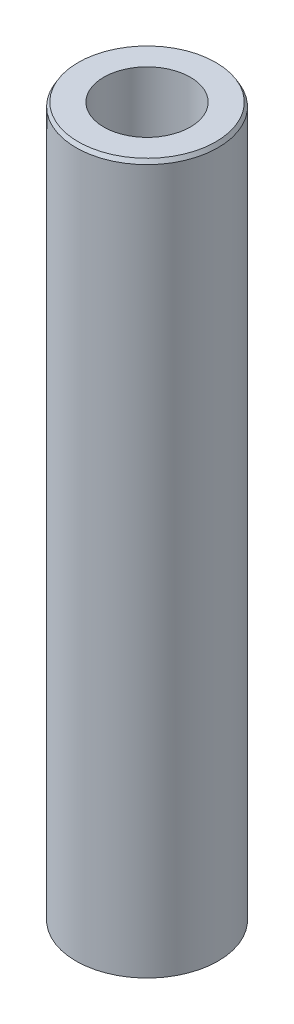
ISO-10303-21;
HEADER;
FILE_DESCRIPTION(('STEP AP214'),'2;1');
FILE_NAME('part.step','',(''),(''),'','','');
FILE_SCHEMA(('AUTOMOTIVE_DESIGN { 1 0 10303 214 1 1 1 1 }'));
ENDSEC;
DATA;
#1=APPLICATION_CONTEXT('core data for automotive mechanical design processes');
#2=APPLICATION_PROTOCOL_DEFINITION('international standard','automotive_design',2000,#1);
#3=PRODUCT_CONTEXT('',#1,'mechanical');
#4=PRODUCT('Part','Part','',(#3));
#5=PRODUCT_RELATED_PRODUCT_CATEGORY('part','',(#4));
#6=PRODUCT_DEFINITION_FORMATION('','',#4);
#7=PRODUCT_DEFINITION_CONTEXT('part definition',#1,'design');
#8=PRODUCT_DEFINITION('design','',#6,#7);
#9=PRODUCT_DEFINITION_SHAPE('','',#8);
#10=(LENGTH_UNIT() NAMED_UNIT(*) SI_UNIT(.MILLI.,.METRE.));
#11=(NAMED_UNIT(*) PLANE_ANGLE_UNIT() SI_UNIT($,.RADIAN.));
#12=(NAMED_UNIT(*) SI_UNIT($,.STERADIAN.) SOLID_ANGLE_UNIT());
#13=UNCERTAINTY_MEASURE_WITH_UNIT(LENGTH_MEASURE(1.E-05),#10,'distance_accuracy_value','');
#14=(GEOMETRIC_REPRESENTATION_CONTEXT(3) GLOBAL_UNCERTAINTY_ASSIGNED_CONTEXT((#13)) GLOBAL_UNIT_ASSIGNED_CONTEXT((#10,
#11,#12)) REPRESENTATION_CONTEXT('',''));
#15=CARTESIAN_POINT('',(0.,0.,0.));
#16=DIRECTION('',(0.,0.,1.));
#17=DIRECTION('',(1.,0.,0.));
#18=AXIS2_PLACEMENT_3D('',#15,#16,#17);
#19=CARTESIAN_POINT('',(0.,600.,0.));
#20=DIRECTION('',(0.,-1.,0.));
#21=DIRECTION('',(0.,0.,-1.));
#22=AXIS2_PLACEMENT_3D('',#19,#20,#21);
#23=CYLINDRICAL_SURFACE('',#22,60.);
#24=CARTESIAN_POINT('',(0.,596.682397411379,0.));
#25=DIRECTION('',(0.,1.,0.));
#26=DIRECTION('',(0.,0.,1.));
#27=AXIS2_PLACEMENT_3D('',#24,#25,#26);
#28=CIRCLE('',#27,60.);
#29=CARTESIAN_POINT('',(0.,596.682397411379,-60.));
#30=VERTEX_POINT('',#29);
#31=EDGE_CURVE('E50',#30,#30,#28,.F.);
#32=CARTESIAN_POINT('',(0.,1.91541874760426,0.));
#33=DIRECTION('',(0.,1.,0.));
#34=DIRECTION('',(0.,0.,1.));
#35=AXIS2_PLACEMENT_3D('',#32,#33,#34);
#36=CIRCLE('',#35,60.);
#37=CARTESIAN_POINT('',(0.,1.91541874760415,-60.));
#38=VERTEX_POINT('',#37);
#39=EDGE_CURVE('E51',#38,#38,#36,.T.);
#40=CARTESIAN_POINT('',(0.,596.682397411379,-60.));
#41=CARTESIAN_POINT('',(0.,590.486908050298,-60.));
#42=CARTESIAN_POINT('',(0.,584.291418689217,-60.));
#43=CARTESIAN_POINT('',(0.,571.900439967055,-60.));
#44=CARTESIAN_POINT('',(0.,565.704950605974,-60.));
#45=CARTESIAN_POINT('',(0.,553.313971883812,-60.));
#46=CARTESIAN_POINT('',(0.,547.118482522731,-60.));
#47=CARTESIAN_POINT('',(0.,534.727503800569,-60.));
#48=CARTESIAN_POINT('',(0.,528.532014439488,-60.));
#49=CARTESIAN_POINT('',(0.,516.141035717327,-60.));
#50=CARTESIAN_POINT('',(0.,509.945546356245,-60.));
#51=CARTESIAN_POINT('',(0.,497.554567634084,-60.));
#52=CARTESIAN_POINT('',(0.,491.359078273002,-60.));
#53=CARTESIAN_POINT('',(0.,478.96809955084,-60.));
#54=CARTESIAN_POINT('',(0.,472.77261018976,-60.));
#55=CARTESIAN_POINT('',(0.,460.381631467598,-60.));
#56=CARTESIAN_POINT('',(0.,454.186142106517,-60.));
#57=CARTESIAN_POINT('',(0.,441.795163384355,-60.));
#58=CARTESIAN_POINT('',(0.,435.599674023274,-60.));
#59=CARTESIAN_POINT('',(0.,423.208695301112,-60.));
#60=CARTESIAN_POINT('',(0.,417.013205940031,-60.));
#61=CARTESIAN_POINT('',(0.,404.622227217869,-60.));
#62=CARTESIAN_POINT('',(0.,398.426737856788,-60.));
#63=CARTESIAN_POINT('',(0.,386.035759134626,-60.));
#64=CARTESIAN_POINT('',(0.,379.840269773545,-60.));
#65=CARTESIAN_POINT('',(0.,367.449291051383,-60.));
#66=CARTESIAN_POINT('',(0.,361.253801690302,-60.));
#67=CARTESIAN_POINT('',(0.,348.86282296814,-60.));
#68=CARTESIAN_POINT('',(0.,342.667333607059,-60.));
#69=CARTESIAN_POINT('',(0.,330.276354884897,-60.));
#70=CARTESIAN_POINT('',(0.,324.080865523816,-60.));
#71=CARTESIAN_POINT('',(0.,311.689886801654,-60.));
#72=CARTESIAN_POINT('',(0.,305.494397440573,-60.));
#73=CARTESIAN_POINT('',(0.,293.103418718411,-60.));
#74=CARTESIAN_POINT('',(0.,286.90792935733,-60.));
#75=CARTESIAN_POINT('',(0.,274.516950635168,-60.));
#76=CARTESIAN_POINT('',(0.,268.321461274087,-60.));
#77=CARTESIAN_POINT('',(0.,255.930482551925,-60.));
#78=CARTESIAN_POINT('',(0.,249.734993190844,-60.));
#79=CARTESIAN_POINT('',(0.,237.344014468682,-60.));
#80=CARTESIAN_POINT('',(0.,231.148525107601,-60.));
#81=CARTESIAN_POINT('',(0.,218.757546385439,-60.));
#82=CARTESIAN_POINT('',(0.,212.562057024358,-60.));
#83=CARTESIAN_POINT('',(0.,200.171078302196,-60.));
#84=CARTESIAN_POINT('',(0.,193.975588941115,-60.));
#85=CARTESIAN_POINT('',(0.,181.584610218953,-60.));
#86=CARTESIAN_POINT('',(0.,175.389120857872,-60.));
#87=CARTESIAN_POINT('',(0.,162.99814213571,-60.));
#88=CARTESIAN_POINT('',(0.,156.802652774629,-60.));
#89=CARTESIAN_POINT('',(0.,144.411674052467,-60.));
#90=CARTESIAN_POINT('',(0.,138.216184691386,-60.));
#91=CARTESIAN_POINT('',(0.,125.825205969224,-60.));
#92=CARTESIAN_POINT('',(0.,119.629716608143,-60.));
#93=CARTESIAN_POINT('',(0.,107.238737885981,-60.));
#94=CARTESIAN_POINT('',(0.,101.0432485249,-60.));
#95=CARTESIAN_POINT('',(0.,88.652269802738,-60.));
#96=CARTESIAN_POINT('',(0.,82.456780441657,-60.));
#97=CARTESIAN_POINT('',(0.,70.0658017194951,-60.));
#98=CARTESIAN_POINT('',(0.,63.8703123584141,-60.));
#99=CARTESIAN_POINT('',(0.,51.4793336362521,-60.));
#100=CARTESIAN_POINT('',(0.,45.283844275171,-60.));
#101=CARTESIAN_POINT('',(0.,32.892865553009,-60.));
#102=CARTESIAN_POINT('',(0.,26.697376191928,-60.));
#103=CARTESIAN_POINT('',(0.,14.306397469766,-60.));
#104=CARTESIAN_POINT('',(0.,8.1109081086851,-60.));
#105=CARTESIAN_POINT('',(0.,1.91541874760415,-60.));
#106=B_SPLINE_CURVE_WITH_KNOTS('',3,(#40,#41,#42,#43,#44,#45,#46,#47,#48,#49,#50,#51,#52,#53,
#54,#55,#56,#57,#58,#59,#60,#61,#62,#63,#64,#65,#66,#67,#68,#69,#70,#71,#72,#73,#74,#75,#76,#77,
#78,#79,#80,#81,#82,#83,#84,#85,#86,#87,#88,#89,#90,#91,#92,#93,#94,#95,#96,#97,#98,#99,#100,
#101,#102,#103,#104,#105),.UNSPECIFIED.,.F.,.F.,(4,2,2,2,2,2,2,2,2,2,2,2,2,2,2,2,2,2,2,2,2,2,2,
2,2,2,2,2,2,2,2,2,4),(0.,18.5864680832429,37.1729361664859,55.7594042497289,74.3458723329719,
92.9323404162148,111.518808499458,130.105276582701,148.691744665944,167.278212749187,
185.86468083243,204.451148915673,223.037616998916,241.624085082159,260.210553165402,
278.797021248645,297.383489331888,315.969957415131,334.556425498374,353.142893581616,
371.729361664859,390.315829748102,408.902297831345,427.488765914588,446.075233997831,
464.661702081074,483.248170164317,501.83463824756,520.421106330803,539.007574414046,
557.594042497289,576.180510580532,594.766978663775),.UNSPECIFIED.);
#107=EDGE_CURVE('BSEAM39',#30,#38,#106,.T.);
#108=ORIENTED_EDGE('',*,*,#31,.T.);
#109=ORIENTED_EDGE('',*,*,#39,.T.);
#110=ORIENTED_EDGE('',*,*,#107,.T.);
#111=ORIENTED_EDGE('',*,*,#107,.F.);
#112=EDGE_LOOP('',(#108,#110,#109,#111));
#113=FACE_BOUND('',#112,.T.);
#114=ADVANCED_FACE('F39',(#113),#23,.T.);
#115=CARTESIAN_POINT('',(0.,600.,0.));
#116=DIRECTION('',(0.,1.,0.));
#117=DIRECTION('',(0.,0.,1.));
#118=AXIS2_PLACEMENT_3D('',#115,#116,#117);
#119=PLANE('',#118);
#120=CARTESIAN_POINT('',(0.,600.,0.));
#121=DIRECTION('',(0.,1.,0.));
#122=DIRECTION('',(0.,0.,1.));
#123=AXIS2_PLACEMENT_3D('',#120,#121,#122);
#124=CIRCLE('',#123,58.0845812523958);
#125=CARTESIAN_POINT('',(0.,600.,-58.0845812523958));
#126=VERTEX_POINT('',#125);
#127=EDGE_CURVE('E54',#126,#126,#124,.T.);
#128=ORIENTED_EDGE('',*,*,#127,.T.);
#129=EDGE_LOOP('',(#128));
#130=FACE_BOUND('',#129,.T.);
#131=CARTESIAN_POINT('',(0.,600.,0.));
#132=DIRECTION('',(0.,1.,0.));
#133=DIRECTION('',(0.,0.,1.));
#134=AXIS2_PLACEMENT_3D('',#131,#132,#133);
#135=CIRCLE('',#134,36.5133609068791);
#136=CARTESIAN_POINT('',(0.,600.,36.5133609068791));
#137=VERTEX_POINT('',#136);
#138=EDGE_CURVE('E58',#137,#137,#135,.T.);
#139=ORIENTED_EDGE('',*,*,#138,.F.);
#140=EDGE_LOOP('',(#139));
#141=FACE_BOUND('',#140,.T.);
#142=ADVANCED_FACE('F69',(#130,#141),#119,.T.);
#143=CARTESIAN_POINT('',(0.,0.,0.));
#144=DIRECTION('',(0.,1.,0.));
#145=DIRECTION('',(0.,0.,1.));
#146=AXIS2_PLACEMENT_3D('',#143,#144,#145);
#147=PLANE('',#146);
#148=CARTESIAN_POINT('',(0.,0.,0.));
#149=DIRECTION('',(0.,1.,0.));
#150=DIRECTION('',(0.,0.,1.));
#151=AXIS2_PLACEMENT_3D('',#148,#149,#150);
#152=CIRCLE('',#151,56.6823974113794);
#153=CARTESIAN_POINT('',(0.,0.,56.6823974113794));
#154=VERTEX_POINT('',#153);
#155=EDGE_CURVE('E10',#154,#154,#152,.F.);
#156=ORIENTED_EDGE('',*,*,#155,.T.);
#157=EDGE_LOOP('',(#156));
#158=FACE_BOUND('',#157,.T.);
#159=CARTESIAN_POINT('',(0.,0.,0.));
#160=DIRECTION('',(0.,1.,0.));
#161=DIRECTION('',(0.,0.,1.));
#162=AXIS2_PLACEMENT_3D('',#159,#160,#161);
#163=CIRCLE('',#162,36.5133609068791);
#164=CARTESIAN_POINT('',(0.,0.,36.5133609068791));
#165=VERTEX_POINT('',#164);
#166=EDGE_CURVE('E63',#165,#165,#163,.T.);
#167=ORIENTED_EDGE('',*,*,#166,.T.);
#168=EDGE_LOOP('',(#167));
#169=FACE_BOUND('',#168,.T.);
#170=ADVANCED_FACE('F75',(#158,#169),#147,.F.);
#171=CARTESIAN_POINT('',(0.,600.,0.));
#172=DIRECTION('',(0.,-1.,0.));
#173=DIRECTION('',(0.,0.,-1.));
#174=AXIS2_PLACEMENT_3D('',#171,#172,#173);
#175=CYLINDRICAL_SURFACE('',#174,36.5133609068791);
#176=ORIENTED_EDGE('',*,*,#138,.T.);
#177=EDGE_LOOP('',(#176));
#178=FACE_BOUND('',#177,.T.);
#179=ORIENTED_EDGE('',*,*,#166,.F.);
#180=EDGE_LOOP('',(#179));
#181=FACE_BOUND('',#180,.T.);
#182=ADVANCED_FACE('F70',(#178,#181),#175,.F.);
#183=CARTESIAN_POINT('',(0.,600.,0.));
#184=DIRECTION('',(0.,-1.,0.));
#185=DIRECTION('',(0.,0.,-1.));
#186=AXIS2_PLACEMENT_3D('',#183,#184,#185);
#187=CONICAL_SURFACE('',#186,58.0845812523958,0.52359877559828);
#188=CARTESIAN_POINT('',(0.,596.682397411379,-60.));
#189=CARTESIAN_POINT('',(0.,596.716955771677,-59.9800477213792));
#190=CARTESIAN_POINT('',(0.,596.751514131976,-59.9600954427583));
#191=CARTESIAN_POINT('',(0.,596.820630852572,-59.9201908855165));
#192=CARTESIAN_POINT('',(0.,596.85518921287,-59.9002386068956));
#193=CARTESIAN_POINT('',(0.,596.924305933466,-59.8603340496539));
#194=CARTESIAN_POINT('',(0.,596.958864293764,-59.840381771033));
#195=CARTESIAN_POINT('',(0.,597.027981014361,-59.8004772137913));
#196=CARTESIAN_POINT('',(0.,597.062539374659,-59.7805249351704));
#197=CARTESIAN_POINT('',(0.,597.131656095255,-59.7406203779286));
#198=CARTESIAN_POINT('',(0.,597.166214455553,-59.7206680993077));
#199=CARTESIAN_POINT('',(0.,597.235331176149,-59.680763542066));
#200=CARTESIAN_POINT('',(0.,597.269889536448,-59.6608112634451));
#201=CARTESIAN_POINT('',(0.,597.339006257044,-59.6209067062034));
#202=CARTESIAN_POINT('',(0.,597.373564617342,-59.6009544275825));
#203=CARTESIAN_POINT('',(0.,597.442681337938,-59.5610498703407));
#204=CARTESIAN_POINT('',(0.,597.477239698236,-59.5410975917199));
#205=CARTESIAN_POINT('',(0.,597.546356418833,-59.5011930344781));
#206=CARTESIAN_POINT('',(0.,597.580914779131,-59.4812407558572));
#207=CARTESIAN_POINT('',(0.,597.650031499727,-59.4413361986155));
#208=CARTESIAN_POINT('',(0.,597.684589860025,-59.4213839199946));
#209=CARTESIAN_POINT('',(0.,597.753706580621,-59.3814793627528));
#210=CARTESIAN_POINT('',(0.,597.788264940919,-59.361527084132));
#211=CARTESIAN_POINT('',(0.,597.857381661516,-59.3216225268902));
#212=CARTESIAN_POINT('',(0.,597.891940021814,-59.3016702482693));
#213=CARTESIAN_POINT('',(0.,597.96105674241,-59.2617656910276));
#214=CARTESIAN_POINT('',(0.,597.995615102708,-59.2418134124067));
#215=CARTESIAN_POINT('',(0.,598.064731823305,-59.201908855165));
#216=CARTESIAN_POINT('',(0.,598.099290183603,-59.1819565765441));
#217=CARTESIAN_POINT('',(0.,598.168406904199,-59.1420520193023));
#218=CARTESIAN_POINT('',(0.,598.202965264497,-59.1220997406814));
#219=CARTESIAN_POINT('',(0.,598.272081985093,-59.0821951834397));
#220=CARTESIAN_POINT('',(0.,598.306640345392,-59.0622429048188));
#221=CARTESIAN_POINT('',(0.,598.375757065988,-59.0223383475771));
#222=CARTESIAN_POINT('',(0.,598.410315426286,-59.0023860689562));
#223=CARTESIAN_POINT('',(0.,598.479432146882,-58.9624815117144));
#224=CARTESIAN_POINT('',(0.,598.51399050718,-58.9425292330935));
#225=CARTESIAN_POINT('',(0.,598.583107227777,-58.9026246758518));
#226=CARTESIAN_POINT('',(0.,598.617665588075,-58.8826723972309));
#227=CARTESIAN_POINT('',(0.,598.686782308671,-58.8427678399892));
#228=CARTESIAN_POINT('',(0.,598.721340668969,-58.8228155613683));
#229=CARTESIAN_POINT('',(0.,598.790457389565,-58.7829110041265));
#230=CARTESIAN_POINT('',(0.,598.825015749863,-58.7629587255056));
#231=CARTESIAN_POINT('',(0.,598.89413247046,-58.7230541682639));
#232=CARTESIAN_POINT('',(0.,598.928690830758,-58.703101889643));
#233=CARTESIAN_POINT('',(0.,598.997807551354,-58.6631973324013));
#234=CARTESIAN_POINT('',(0.,599.032365911652,-58.6432450537804));
#235=CARTESIAN_POINT('',(0.,599.101482632248,-58.6033404965386));
#236=CARTESIAN_POINT('',(0.,599.136040992547,-58.5833882179178));
#237=CARTESIAN_POINT('',(0.,599.205157713143,-58.543483660676));
#238=CARTESIAN_POINT('',(0.,599.239716073441,-58.5235313820551));
#239=CARTESIAN_POINT('',(0.,599.308832794037,-58.4836268248134));
#240=CARTESIAN_POINT('',(0.,599.343391154335,-58.4636745461925));
#241=CARTESIAN_POINT('',(0.,599.412507874932,-58.4237699889507));
#242=CARTESIAN_POINT('',(0.,599.44706623523,-58.4038177103299));
#243=CARTESIAN_POINT('',(0.,599.516182955826,-58.3639131530881));
#244=CARTESIAN_POINT('',(0.,599.550741316124,-58.3439608744672));
#245=CARTESIAN_POINT('',(0.,599.61985803672,-58.3040563172255));
#246=CARTESIAN_POINT('',(0.,599.654416397019,-58.2841040386046));
#247=CARTESIAN_POINT('',(0.,599.723533117615,-58.2441994813628));
#248=CARTESIAN_POINT('',(0.,599.758091477913,-58.224247202742));
#249=CARTESIAN_POINT('',(0.,599.827208198509,-58.1843426455002));
#250=CARTESIAN_POINT('',(0.,599.861766558807,-58.1643903668793));
#251=CARTESIAN_POINT('',(0.,599.930883279404,-58.1244858096376));
#252=CARTESIAN_POINT('',(0.,599.965441639702,-58.1045335310167));
#253=CARTESIAN_POINT('',(0.,600.,-58.0845812523958));
#254=B_SPLINE_CURVE_WITH_KNOTS('',3,(#188,#189,#190,#191,#192,#193,#194,#195,#196,#197,#198,
#199,#200,#201,#202,#203,#204,#205,#206,#207,#208,#209,#210,#211,#212,#213,#214,#215,#216,#217,
#218,#219,#220,#221,#222,#223,#224,#225,#226,#227,#228,#229,#230,#231,#232,#233,#234,#235,#236,
#237,#238,#239,#240,#241,#242,#243,#244,#245,#246,#247,#248,#249,#250,#251,#252,#253),
.UNSPECIFIED.,.F.,.F.,(4,2,2,2,2,2,2,2,2,2,2,2,2,2,2,2,2,2,2,2,2,2,2,2,2,2,2,2,2,2,2,2,4),(0.,
0.119713671725249,0.239427343450499,0.359141015175748,0.478854686900994,0.598568358626244,
0.718282030351589,0.837995702076839,0.957709373802085,1.07742304552733,1.19713671725258,
1.31685038897793,1.43656406070318,1.55627773242842,1.67599140415367,1.79570507587892,
1.91541874760427,2.03513241932952,2.15484609105476,2.27455976278001,2.39427343450526,
2.51398710623051,2.63370077795585,2.7534144496811,2.87312812140635,2.9928417931316,
3.11255546485685,3.23226913658219,3.35198280830744,3.47169648003269,3.59141015175794,
3.71112382348319,3.83083749520853),.UNSPECIFIED.);
#255=EDGE_CURVE('BSEAM81',#30,#126,#254,.T.);
#256=ORIENTED_EDGE('',*,*,#31,.F.);
#257=ORIENTED_EDGE('',*,*,#127,.F.);
#258=ORIENTED_EDGE('',*,*,#255,.T.);
#259=ORIENTED_EDGE('',*,*,#255,.F.);
#260=EDGE_LOOP('',(#256,#258,#257,#259));
#261=FACE_BOUND('',#260,.T.);
#262=ADVANCED_FACE('F81',(#261),#187,.T.);
#263=CARTESIAN_POINT('',(0.,1.91541874760426,0.));
#264=DIRECTION('',(0.,1.,0.));
#265=DIRECTION('',(0.,0.,1.));
#266=AXIS2_PLACEMENT_3D('',#263,#264,#265);
#267=CONICAL_SURFACE('',#266,60.,1.0471975511966);
#268=ORIENTED_EDGE('',*,*,#155,.F.);
#269=EDGE_LOOP('',(#268));
#270=FACE_BOUND('',#269,.T.);
#271=ORIENTED_EDGE('',*,*,#39,.F.);
#272=EDGE_LOOP('',(#271));
#273=FACE_BOUND('',#272,.T.);
#274=ADVANCED_FACE('F45',(#270,#273),#267,.T.);
#275=CLOSED_SHELL('',(#114,#142,#170,#182,#262,#274));
#276=MANIFOLD_SOLID_BREP('B2',#275);
#277=ADVANCED_BREP_SHAPE_REPRESENTATION('',(#18,#276),#14);
#278=SHAPE_DEFINITION_REPRESENTATION(#9,#277);
ENDSEC;
END-ISO-10303-21;
